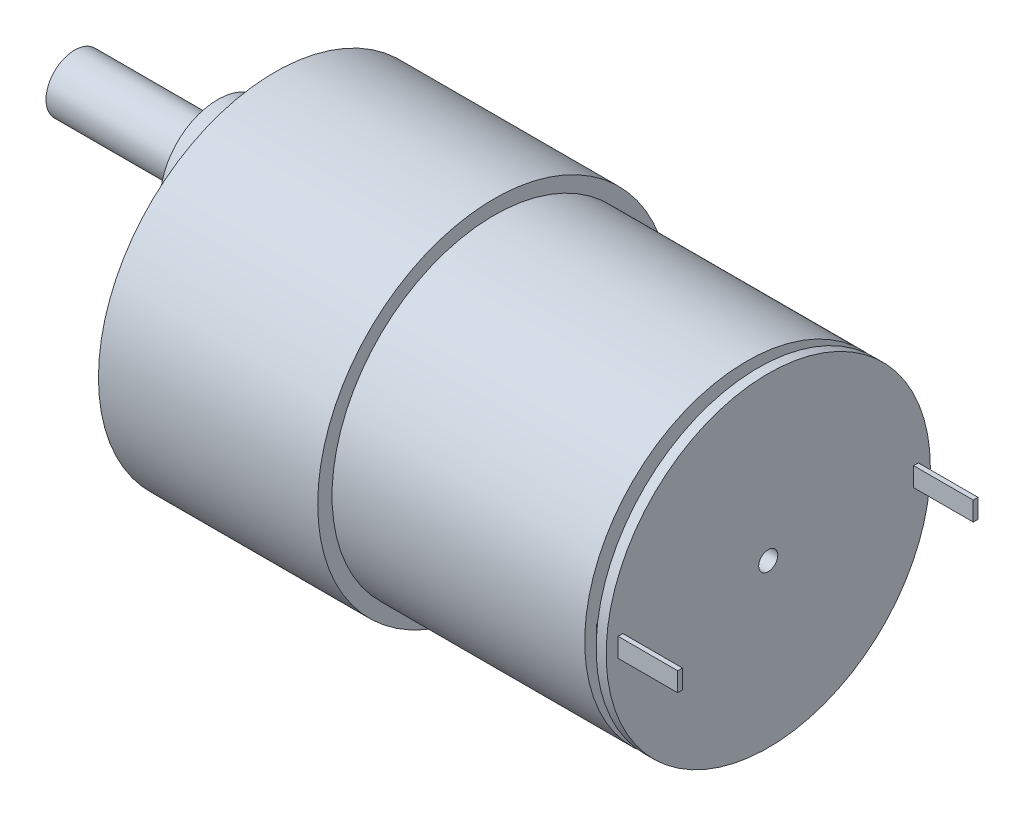
ISO-10303-21;
HEADER;
FILE_DESCRIPTION(('STEP AP214'),'2;1');
FILE_NAME('part.step','',(''),(''),'','','');
FILE_SCHEMA(('AUTOMOTIVE_DESIGN { 1 0 10303 214 1 1 1 1 }'));
ENDSEC;
DATA;
#1=APPLICATION_CONTEXT('core data for automotive mechanical design processes');
#2=APPLICATION_PROTOCOL_DEFINITION('international standard','automotive_design',2000,#1);
#3=PRODUCT_CONTEXT('',#1,'mechanical');
#4=PRODUCT('Part','Part','',(#3));
#5=PRODUCT_RELATED_PRODUCT_CATEGORY('part','',(#4));
#6=PRODUCT_DEFINITION_FORMATION('','',#4);
#7=PRODUCT_DEFINITION_CONTEXT('part definition',#1,'design');
#8=PRODUCT_DEFINITION('design','',#6,#7);
#9=PRODUCT_DEFINITION_SHAPE('','',#8);
#10=(LENGTH_UNIT() NAMED_UNIT(*) SI_UNIT(.MILLI.,.METRE.));
#11=(NAMED_UNIT(*) PLANE_ANGLE_UNIT() SI_UNIT($,.RADIAN.));
#12=(NAMED_UNIT(*) SI_UNIT($,.STERADIAN.) SOLID_ANGLE_UNIT());
#13=UNCERTAINTY_MEASURE_WITH_UNIT(LENGTH_MEASURE(1.E-05),#10,'distance_accuracy_value','');
#14=(GEOMETRIC_REPRESENTATION_CONTEXT(3) GLOBAL_UNCERTAINTY_ASSIGNED_CONTEXT((#13)) GLOBAL_UNIT_ASSIGNED_CONTEXT((#10,
#11,#12)) REPRESENTATION_CONTEXT('',''));
#15=CARTESIAN_POINT('',(0.,0.,0.));
#16=DIRECTION('',(0.,0.,1.));
#17=DIRECTION('',(1.,0.,0.));
#18=AXIS2_PLACEMENT_3D('',#15,#16,#17);
#19=CARTESIAN_POINT('',(40.2,0.,0.));
#20=DIRECTION('',(1.,0.,0.));
#21=DIRECTION('',(0.,0.,-1.));
#22=AXIS2_PLACEMENT_3D('',#19,#20,#21);
#23=CYLINDRICAL_SURFACE('',#22,17.);
#24=CARTESIAN_POINT('',(40.2,0.,0.));
#25=DIRECTION('',(1.,0.,0.));
#26=DIRECTION('',(0.,0.,-1.));
#27=AXIS2_PLACEMENT_3D('',#24,#25,#26);
#28=CIRCLE('',#27,17.);
#29=CARTESIAN_POINT('',(40.2,0.,-17.));
#30=VERTEX_POINT('',#29);
#31=EDGE_CURVE('E341',#30,#30,#28,.T.);
#32=ORIENTED_EDGE('',*,*,#31,.T.);
#33=EDGE_LOOP('',(#32));
#34=FACE_BOUND('',#33,.T.);
#35=CARTESIAN_POINT('',(41.25,0.,0.));
#36=DIRECTION('',(1.,0.,0.));
#37=DIRECTION('',(0.,0.,-1.));
#38=AXIS2_PLACEMENT_3D('',#35,#36,#37);
#39=CIRCLE('',#38,17.);
#40=CARTESIAN_POINT('',(41.25,0.,-17.));
#41=VERTEX_POINT('',#40);
#42=EDGE_CURVE('E340',#41,#41,#39,.T.);
#43=ORIENTED_EDGE('',*,*,#42,.F.);
#44=EDGE_LOOP('',(#43));
#45=FACE_BOUND('',#44,.T.);
#46=ADVANCED_FACE('F32',(#34,#45),#23,.T.);
#47=CARTESIAN_POINT('',(40.2,0.,0.));
#48=DIRECTION('',(1.,0.,0.));
#49=DIRECTION('',(0.,0.,-1.));
#50=AXIS2_PLACEMENT_3D('',#47,#48,#49);
#51=PLANE('',#50);
#52=CARTESIAN_POINT('',(40.2,-2.21813606772281E-13,0.));
#53=DIRECTION('',(1.,0.,0.));
#54=DIRECTION('',(0.,0.,-1.));
#55=AXIS2_PLACEMENT_3D('',#52,#53,#54);
#56=CIRCLE('',#55,1.5);
#57=CARTESIAN_POINT('',(40.2,-2.21813606772281E-13,-1.49999999999998));
#58=VERTEX_POINT('',#57);
#59=EDGE_CURVE('E11',#58,#58,#56,.F.);
#60=ORIENTED_EDGE('',*,*,#59,.F.);
#61=EDGE_LOOP('',(#60));
#62=FACE_BOUND('',#61,.T.);
#63=DIRECTION('',(0.,1.,0.));
#64=VECTOR('',#63,1.);
#65=CARTESIAN_POINT('',(40.2,0.,-15.75));
#66=LINE('',#65,#64);
#67=CARTESIAN_POINT('',(40.2,-0.999999999999999,-15.75));
#68=VERTEX_POINT('',#67);
#69=CARTESIAN_POINT('',(40.2,0.999999999999999,-15.75));
#70=VERTEX_POINT('',#69);
#71=EDGE_CURVE('E264',#68,#70,#66,.T.);
#72=ORIENTED_EDGE('',*,*,#71,.T.);
#73=DIRECTION('',(0.,0.,1.));
#74=VECTOR('',#73,1.);
#75=CARTESIAN_POINT('',(40.2,0.999999999999999,0.));
#76=LINE('',#75,#74);
#77=CARTESIAN_POINT('',(40.2,0.999999999999999,-15.25));
#78=VERTEX_POINT('',#77);
#79=EDGE_CURVE('E285',#70,#78,#76,.T.);
#80=ORIENTED_EDGE('',*,*,#79,.T.);
#81=DIRECTION('',(0.,-1.,0.));
#82=VECTOR('',#81,1.);
#83=CARTESIAN_POINT('',(40.2,0.,-15.25));
#84=LINE('',#83,#82);
#85=CARTESIAN_POINT('',(40.2,-0.999999999999999,-15.25));
#86=VERTEX_POINT('',#85);
#87=EDGE_CURVE('E282',#78,#86,#84,.T.);
#88=ORIENTED_EDGE('',*,*,#87,.T.);
#89=DIRECTION('',(0.,0.,-1.));
#90=VECTOR('',#89,1.);
#91=CARTESIAN_POINT('',(40.2,-0.999999999999999,0.));
#92=LINE('',#91,#90);
#93=EDGE_CURVE('E279',#86,#68,#92,.T.);
#94=ORIENTED_EDGE('',*,*,#93,.T.);
#95=EDGE_LOOP('',(#72,#80,#88,#94));
#96=FACE_BOUND('',#95,.T.);
#97=DIRECTION('',(0.,1.,0.));
#98=VECTOR('',#97,1.);
#99=CARTESIAN_POINT('',(40.2,0.,15.25));
#100=LINE('',#99,#98);
#101=CARTESIAN_POINT('',(40.2,-0.999999999999999,15.25));
#102=VERTEX_POINT('',#101);
#103=CARTESIAN_POINT('',(40.2,0.999999999999999,15.25));
#104=VERTEX_POINT('',#103);
#105=EDGE_CURVE('E316',#102,#104,#100,.T.);
#106=ORIENTED_EDGE('',*,*,#105,.T.);
#107=DIRECTION('',(0.,0.,1.));
#108=VECTOR('',#107,1.);
#109=CARTESIAN_POINT('',(40.2,0.999999999999999,0.));
#110=LINE('',#109,#108);
#111=CARTESIAN_POINT('',(40.2,0.999999999999999,15.75));
#112=VERTEX_POINT('',#111);
#113=EDGE_CURVE('E337',#104,#112,#110,.T.);
#114=ORIENTED_EDGE('',*,*,#113,.T.);
#115=DIRECTION('',(0.,-1.,0.));
#116=VECTOR('',#115,1.);
#117=CARTESIAN_POINT('',(40.2,0.,15.75));
#118=LINE('',#117,#116);
#119=CARTESIAN_POINT('',(40.2,-0.999999999999999,15.75));
#120=VERTEX_POINT('',#119);
#121=EDGE_CURVE('E334',#112,#120,#118,.T.);
#122=ORIENTED_EDGE('',*,*,#121,.T.);
#123=DIRECTION('',(0.,0.,-1.));
#124=VECTOR('',#123,1.);
#125=CARTESIAN_POINT('',(40.2,-0.999999999999999,0.));
#126=LINE('',#125,#124);
#127=EDGE_CURVE('E331',#120,#102,#126,.T.);
#128=ORIENTED_EDGE('',*,*,#127,.T.);
#129=EDGE_LOOP('',(#106,#114,#122,#128));
#130=FACE_BOUND('',#129,.T.);
#131=ORIENTED_EDGE('',*,*,#31,.F.);
#132=EDGE_LOOP('',(#131));
#133=FACE_BOUND('',#132,.T.);
#134=ADVANCED_FACE('F394',(#62,#96,#130,#133),#51,.F.);
#135=CARTESIAN_POINT('',(41.25,0.,0.));
#136=DIRECTION('',(1.,0.,0.));
#137=DIRECTION('',(0.,0.,-1.));
#138=AXIS2_PLACEMENT_3D('',#135,#136,#137);
#139=PLANE('',#138);
#140=CARTESIAN_POINT('',(41.25,-1.46316292415369E-13,0.));
#141=DIRECTION('',(1.,0.,0.));
#142=DIRECTION('',(0.,0.,-1.));
#143=AXIS2_PLACEMENT_3D('',#140,#141,#142);
#144=CIRCLE('',#143,0.999999999999989);
#145=CARTESIAN_POINT('',(41.25,-1.46316292415369E-13,-1.00000000000001));
#146=VERTEX_POINT('',#145);
#147=EDGE_CURVE('E207',#146,#146,#144,.T.);
#148=ORIENTED_EDGE('',*,*,#147,.F.);
#149=EDGE_LOOP('',(#148));
#150=FACE_BOUND('',#149,.T.);
#151=DIRECTION('',(0.,0.,1.));
#152=VECTOR('',#151,1.);
#153=CARTESIAN_POINT('',(41.25,0.999999999999999,0.));
#154=LINE('',#153,#152);
#155=CARTESIAN_POINT('',(41.25,0.999999999999999,-15.75));
#156=VERTEX_POINT('',#155);
#157=CARTESIAN_POINT('',(41.25,0.999999999999999,-15.25));
#158=VERTEX_POINT('',#157);
#159=EDGE_CURVE('E39',#156,#158,#154,.T.);
#160=ORIENTED_EDGE('',*,*,#159,.F.);
#161=DIRECTION('',(0.,1.,0.));
#162=VECTOR('',#161,1.);
#163=CARTESIAN_POINT('',(41.25,0.,-15.75));
#164=LINE('',#163,#162);
#165=CARTESIAN_POINT('',(41.25,-0.999999999999999,-15.75));
#166=VERTEX_POINT('',#165);
#167=EDGE_CURVE('E358',#166,#156,#164,.T.);
#168=ORIENTED_EDGE('',*,*,#167,.F.);
#169=DIRECTION('',(0.,0.,-1.));
#170=VECTOR('',#169,1.);
#171=CARTESIAN_POINT('',(41.25,-0.999999999999999,0.));
#172=LINE('',#171,#170);
#173=CARTESIAN_POINT('',(41.25,-0.999999999999999,-15.25));
#174=VERTEX_POINT('',#173);
#175=EDGE_CURVE('E361',#174,#166,#172,.T.);
#176=ORIENTED_EDGE('',*,*,#175,.F.);
#177=DIRECTION('',(0.,-1.,0.));
#178=VECTOR('',#177,1.);
#179=CARTESIAN_POINT('',(41.25,0.,-15.25));
#180=LINE('',#179,#178);
#181=EDGE_CURVE('E54',#158,#174,#180,.T.);
#182=ORIENTED_EDGE('',*,*,#181,.F.);
#183=EDGE_LOOP('',(#160,#168,#176,#182));
#184=FACE_BOUND('',#183,.T.);
#185=DIRECTION('',(0.,0.,1.));
#186=VECTOR('',#185,1.);
#187=CARTESIAN_POINT('',(41.25,0.999999999999999,0.));
#188=LINE('',#187,#186);
#189=CARTESIAN_POINT('',(41.25,0.999999999999999,15.25));
#190=VERTEX_POINT('',#189);
#191=CARTESIAN_POINT('',(41.25,0.999999999999999,15.75));
#192=VERTEX_POINT('',#191);
#193=EDGE_CURVE('E355',#190,#192,#188,.T.);
#194=ORIENTED_EDGE('',*,*,#193,.F.);
#195=DIRECTION('',(0.,1.,0.));
#196=VECTOR('',#195,1.);
#197=CARTESIAN_POINT('',(41.25,0.,15.25));
#198=LINE('',#197,#196);
#199=CARTESIAN_POINT('',(41.25,-0.999999999999999,15.25));
#200=VERTEX_POINT('',#199);
#201=EDGE_CURVE('E344',#200,#190,#198,.T.);
#202=ORIENTED_EDGE('',*,*,#201,.F.);
#203=DIRECTION('',(0.,0.,-1.));
#204=VECTOR('',#203,1.);
#205=CARTESIAN_POINT('',(41.25,-0.999999999999999,0.));
#206=LINE('',#205,#204);
#207=CARTESIAN_POINT('',(41.25,-0.999999999999999,15.75));
#208=VERTEX_POINT('',#207);
#209=EDGE_CURVE('E349',#208,#200,#206,.T.);
#210=ORIENTED_EDGE('',*,*,#209,.F.);
#211=DIRECTION('',(0.,-1.,0.));
#212=VECTOR('',#211,1.);
#213=CARTESIAN_POINT('',(41.25,0.,15.75));
#214=LINE('',#213,#212);
#215=EDGE_CURVE('E352',#192,#208,#214,.T.);
#216=ORIENTED_EDGE('',*,*,#215,.F.);
#217=EDGE_LOOP('',(#194,#202,#210,#216));
#218=FACE_BOUND('',#217,.T.);
#219=ORIENTED_EDGE('',*,*,#42,.T.);
#220=EDGE_LOOP('',(#219));
#221=FACE_BOUND('',#220,.T.);
#222=ADVANCED_FACE('F376',(#150,#184,#218,#221),#139,.T.);
#223=CARTESIAN_POINT('',(47.5,0.,0.));
#224=DIRECTION('',(1.,0.,0.));
#225=DIRECTION('',(0.,0.,-1.));
#226=AXIS2_PLACEMENT_3D('',#223,#224,#225);
#227=PLANE('',#226);
#228=DIRECTION('',(0.,0.,-1.));
#229=VECTOR('',#228,1.);
#230=CARTESIAN_POINT('',(47.5,0.999999999999999,15.25));
#231=LINE('',#230,#229);
#232=CARTESIAN_POINT('',(47.5,0.999999999999999,15.75));
#233=VERTEX_POINT('',#232);
#234=CARTESIAN_POINT('',(47.5,0.999999999999999,15.25));
#235=VERTEX_POINT('',#234);
#236=EDGE_CURVE('E300',#233,#235,#231,.T.);
#237=ORIENTED_EDGE('',*,*,#236,.F.);
#238=DIRECTION('',(0.,1.,0.));
#239=VECTOR('',#238,1.);
#240=CARTESIAN_POINT('',(47.5,0.999999999999999,15.75));
#241=LINE('',#240,#239);
#242=CARTESIAN_POINT('',(47.5,-0.999999999999999,15.75));
#243=VERTEX_POINT('',#242);
#244=EDGE_CURVE('E309',#243,#233,#241,.T.);
#245=ORIENTED_EDGE('',*,*,#244,.F.);
#246=DIRECTION('',(0.,0.,1.));
#247=VECTOR('',#246,1.);
#248=CARTESIAN_POINT('',(47.5,-0.999999999999999,15.75));
#249=LINE('',#248,#247);
#250=CARTESIAN_POINT('',(47.5,-0.999999999999999,15.25));
#251=VERTEX_POINT('',#250);
#252=EDGE_CURVE('E306',#251,#243,#249,.T.);
#253=ORIENTED_EDGE('',*,*,#252,.F.);
#254=DIRECTION('',(0.,-1.,0.));
#255=VECTOR('',#254,1.);
#256=CARTESIAN_POINT('',(47.5,-0.999999999999999,15.25));
#257=LINE('',#256,#255);
#258=EDGE_CURVE('E303',#235,#251,#257,.T.);
#259=ORIENTED_EDGE('',*,*,#258,.F.);
#260=EDGE_LOOP('',(#237,#245,#253,#259));
#261=FACE_BOUND('',#260,.T.);
#262=ADVANCED_FACE('F406',(#261),#227,.T.);
#263=CARTESIAN_POINT('',(47.5,-0.999999999999999,15.25));
#264=DIRECTION('',(0.,0.,-1.));
#265=DIRECTION('',(-1.,0.,0.));
#266=AXIS2_PLACEMENT_3D('',#263,#264,#265);
#267=PLANE('',#266);
#268=DIRECTION('',(-1.,0.,0.));
#269=VECTOR('',#268,1.);
#270=CARTESIAN_POINT('',(47.5,-0.999999999999999,15.25));
#271=LINE('',#270,#269);
#272=EDGE_CURVE('E322',#251,#200,#271,.T.);
#273=ORIENTED_EDGE('',*,*,#272,.T.);
#274=ORIENTED_EDGE('',*,*,#201,.T.);
#275=DIRECTION('',(-1.,0.,0.));
#276=VECTOR('',#275,1.);
#277=CARTESIAN_POINT('',(47.5,0.999999999999999,15.25));
#278=LINE('',#277,#276);
#279=EDGE_CURVE('E326',#235,#190,#278,.T.);
#280=ORIENTED_EDGE('',*,*,#279,.F.);
#281=ORIENTED_EDGE('',*,*,#258,.T.);
#282=EDGE_LOOP('',(#273,#274,#280,#281));
#283=FACE_BOUND('',#282,.T.);
#284=ADVANCED_FACE('F411',(#283),#267,.T.);
#285=CARTESIAN_POINT('',(47.5,-0.999999999999999,15.75));
#286=DIRECTION('',(0.,-1.,0.));
#287=DIRECTION('',(0.,0.,-1.));
#288=AXIS2_PLACEMENT_3D('',#285,#286,#287);
#289=PLANE('',#288);
#290=DIRECTION('',(-1.,0.,0.));
#291=VECTOR('',#290,1.);
#292=CARTESIAN_POINT('',(47.5,-0.999999999999999,15.75));
#293=LINE('',#292,#291);
#294=EDGE_CURVE('E318',#243,#208,#293,.T.);
#295=ORIENTED_EDGE('',*,*,#294,.T.);
#296=ORIENTED_EDGE('',*,*,#209,.T.);
#297=ORIENTED_EDGE('',*,*,#272,.F.);
#298=ORIENTED_EDGE('',*,*,#252,.T.);
#299=EDGE_LOOP('',(#295,#296,#297,#298));
#300=FACE_BOUND('',#299,.T.);
#301=ADVANCED_FACE('F424',(#300),#289,.T.);
#302=CARTESIAN_POINT('',(47.5,0.999999999999999,15.75));
#303=DIRECTION('',(0.,0.,1.));
#304=DIRECTION('',(1.,0.,0.));
#305=AXIS2_PLACEMENT_3D('',#302,#303,#304);
#306=PLANE('',#305);
#307=DIRECTION('',(-1.,0.,0.));
#308=VECTOR('',#307,1.);
#309=CARTESIAN_POINT('',(47.5,0.999999999999999,15.75));
#310=LINE('',#309,#308);
#311=EDGE_CURVE('E313',#233,#192,#310,.T.);
#312=ORIENTED_EDGE('',*,*,#311,.T.);
#313=ORIENTED_EDGE('',*,*,#215,.T.);
#314=ORIENTED_EDGE('',*,*,#294,.F.);
#315=ORIENTED_EDGE('',*,*,#244,.T.);
#316=EDGE_LOOP('',(#312,#313,#314,#315));
#317=FACE_BOUND('',#316,.T.);
#318=ADVANCED_FACE('F420',(#317),#306,.T.);
#319=CARTESIAN_POINT('',(47.5,0.999999999999999,15.25));
#320=DIRECTION('',(0.,1.,0.));
#321=DIRECTION('',(0.,0.,1.));
#322=AXIS2_PLACEMENT_3D('',#319,#320,#321);
#323=PLANE('',#322);
#324=ORIENTED_EDGE('',*,*,#279,.T.);
#325=ORIENTED_EDGE('',*,*,#193,.T.);
#326=ORIENTED_EDGE('',*,*,#311,.F.);
#327=ORIENTED_EDGE('',*,*,#236,.T.);
#328=EDGE_LOOP('',(#324,#325,#326,#327));
#329=FACE_BOUND('',#328,.T.);
#330=ADVANCED_FACE('F416',(#329),#323,.T.);
#331=ORIENTED_EDGE('',*,*,#113,.F.);
#332=CARTESIAN_POINT('',(39.,0.999999999999999,15.25));
#333=VERTEX_POINT('',#332);
#334=EDGE_CURVE('E312',#104,#333,#278,.T.);
#335=ORIENTED_EDGE('',*,*,#334,.T.);
#336=DIRECTION('',(0.,0.,-1.));
#337=VECTOR('',#336,1.);
#338=CARTESIAN_POINT('',(39.,0.999999999999999,15.25));
#339=LINE('',#338,#337);
#340=CARTESIAN_POINT('',(39.,0.999999999999999,15.75));
#341=VERTEX_POINT('',#340);
#342=EDGE_CURVE('E288',#341,#333,#339,.T.);
#343=ORIENTED_EDGE('',*,*,#342,.F.);
#344=EDGE_CURVE('E317',#112,#341,#310,.T.);
#345=ORIENTED_EDGE('',*,*,#344,.F.);
#346=EDGE_LOOP('',(#331,#335,#343,#345));
#347=FACE_BOUND('',#346,.T.);
#348=ADVANCED_FACE('F419',(#347),#323,.T.);
#349=ORIENTED_EDGE('',*,*,#121,.F.);
#350=ORIENTED_EDGE('',*,*,#344,.T.);
#351=DIRECTION('',(0.,1.,0.));
#352=VECTOR('',#351,1.);
#353=CARTESIAN_POINT('',(39.,0.999999999999999,15.75));
#354=LINE('',#353,#352);
#355=CARTESIAN_POINT('',(39.,-0.999999999999999,15.75));
#356=VERTEX_POINT('',#355);
#357=EDGE_CURVE('E297',#356,#341,#354,.T.);
#358=ORIENTED_EDGE('',*,*,#357,.F.);
#359=EDGE_CURVE('E321',#120,#356,#293,.T.);
#360=ORIENTED_EDGE('',*,*,#359,.F.);
#361=EDGE_LOOP('',(#349,#350,#358,#360));
#362=FACE_BOUND('',#361,.T.);
#363=ADVANCED_FACE('F433',(#362),#306,.T.);
#364=ORIENTED_EDGE('',*,*,#127,.F.);
#365=ORIENTED_EDGE('',*,*,#359,.T.);
#366=DIRECTION('',(0.,0.,1.));
#367=VECTOR('',#366,1.);
#368=CARTESIAN_POINT('',(39.,-0.999999999999999,15.75));
#369=LINE('',#368,#367);
#370=CARTESIAN_POINT('',(39.,-0.999999999999999,15.25));
#371=VERTEX_POINT('',#370);
#372=EDGE_CURVE('E294',#371,#356,#369,.T.);
#373=ORIENTED_EDGE('',*,*,#372,.F.);
#374=EDGE_CURVE('E325',#102,#371,#271,.T.);
#375=ORIENTED_EDGE('',*,*,#374,.F.);
#376=EDGE_LOOP('',(#364,#365,#373,#375));
#377=FACE_BOUND('',#376,.T.);
#378=ADVANCED_FACE('F430',(#377),#289,.T.);
#379=ORIENTED_EDGE('',*,*,#105,.F.);
#380=ORIENTED_EDGE('',*,*,#374,.T.);
#381=DIRECTION('',(0.,-1.,0.));
#382=VECTOR('',#381,1.);
#383=CARTESIAN_POINT('',(39.,-0.999999999999999,15.25));
#384=LINE('',#383,#382);
#385=EDGE_CURVE('E291',#333,#371,#384,.T.);
#386=ORIENTED_EDGE('',*,*,#385,.F.);
#387=ORIENTED_EDGE('',*,*,#334,.F.);
#388=EDGE_LOOP('',(#379,#380,#386,#387));
#389=FACE_BOUND('',#388,.T.);
#390=ADVANCED_FACE('F426',(#389),#267,.T.);
#391=CARTESIAN_POINT('',(47.5,0.,0.));
#392=DIRECTION('',(1.,0.,0.));
#393=DIRECTION('',(0.,0.,-1.));
#394=AXIS2_PLACEMENT_3D('',#391,#392,#393);
#395=PLANE('',#394);
#396=DIRECTION('',(0.,0.,-1.));
#397=VECTOR('',#396,1.);
#398=CARTESIAN_POINT('',(47.5,0.999999999999999,-15.75));
#399=LINE('',#398,#397);
#400=CARTESIAN_POINT('',(47.5,0.999999999999999,-15.25));
#401=VERTEX_POINT('',#400);
#402=CARTESIAN_POINT('',(47.5,0.999999999999999,-15.75));
#403=VERTEX_POINT('',#402);
#404=EDGE_CURVE('E249',#401,#403,#399,.T.);
#405=ORIENTED_EDGE('',*,*,#404,.F.);
#406=DIRECTION('',(0.,1.,0.));
#407=VECTOR('',#406,1.);
#408=CARTESIAN_POINT('',(47.5,0.999999999999999,-15.25));
#409=LINE('',#408,#407);
#410=CARTESIAN_POINT('',(47.5,-0.999999999999999,-15.25));
#411=VERTEX_POINT('',#410);
#412=EDGE_CURVE('E258',#411,#401,#409,.T.);
#413=ORIENTED_EDGE('',*,*,#412,.F.);
#414=DIRECTION('',(0.,0.,1.));
#415=VECTOR('',#414,1.);
#416=CARTESIAN_POINT('',(47.5,-0.999999999999999,-15.25));
#417=LINE('',#416,#415);
#418=CARTESIAN_POINT('',(47.5,-0.999999999999999,-15.75));
#419=VERTEX_POINT('',#418);
#420=EDGE_CURVE('E255',#419,#411,#417,.T.);
#421=ORIENTED_EDGE('',*,*,#420,.F.);
#422=DIRECTION('',(0.,-1.,0.));
#423=VECTOR('',#422,1.);
#424=CARTESIAN_POINT('',(47.5,-0.999999999999999,-15.75));
#425=LINE('',#424,#423);
#426=EDGE_CURVE('E252',#403,#419,#425,.T.);
#427=ORIENTED_EDGE('',*,*,#426,.F.);
#428=EDGE_LOOP('',(#405,#413,#421,#427));
#429=FACE_BOUND('',#428,.T.);
#430=ADVANCED_FACE('F372',(#429),#395,.T.);
#431=CARTESIAN_POINT('',(47.5,-0.999999999999999,-15.75));
#432=DIRECTION('',(0.,0.,-1.));
#433=DIRECTION('',(-1.,0.,0.));
#434=AXIS2_PLACEMENT_3D('',#431,#432,#433);
#435=PLANE('',#434);
#436=DIRECTION('',(-1.,0.,0.));
#437=VECTOR('',#436,1.);
#438=CARTESIAN_POINT('',(47.5,-0.999999999999999,-15.75));
#439=LINE('',#438,#437);
#440=EDGE_CURVE('E270',#419,#166,#439,.T.);
#441=ORIENTED_EDGE('',*,*,#440,.T.);
#442=ORIENTED_EDGE('',*,*,#167,.T.);
#443=DIRECTION('',(-1.,0.,0.));
#444=VECTOR('',#443,1.);
#445=CARTESIAN_POINT('',(47.5,0.999999999999999,-15.75));
#446=LINE('',#445,#444);
#447=EDGE_CURVE('E274',#403,#156,#446,.T.);
#448=ORIENTED_EDGE('',*,*,#447,.F.);
#449=ORIENTED_EDGE('',*,*,#426,.T.);
#450=EDGE_LOOP('',(#441,#442,#448,#449));
#451=FACE_BOUND('',#450,.T.);
#452=ADVANCED_FACE('F375',(#451),#435,.T.);
#453=CARTESIAN_POINT('',(47.5,-0.999999999999999,-15.25));
#454=DIRECTION('',(0.,-1.,0.));
#455=DIRECTION('',(0.,0.,-1.));
#456=AXIS2_PLACEMENT_3D('',#453,#454,#455);
#457=PLANE('',#456);
#458=DIRECTION('',(-1.,0.,0.));
#459=VECTOR('',#458,1.);
#460=CARTESIAN_POINT('',(47.5,-0.999999999999999,-15.25));
#461=LINE('',#460,#459);
#462=EDGE_CURVE('E266',#411,#174,#461,.T.);
#463=ORIENTED_EDGE('',*,*,#462,.T.);
#464=ORIENTED_EDGE('',*,*,#175,.T.);
#465=ORIENTED_EDGE('',*,*,#440,.F.);
#466=ORIENTED_EDGE('',*,*,#420,.T.);
#467=EDGE_LOOP('',(#463,#464,#465,#466));
#468=FACE_BOUND('',#467,.T.);
#469=ADVANCED_FACE('F379',(#468),#457,.T.);
#470=CARTESIAN_POINT('',(47.5,0.999999999999999,-15.25));
#471=DIRECTION('',(0.,0.,1.));
#472=DIRECTION('',(1.,0.,0.));
#473=AXIS2_PLACEMENT_3D('',#470,#471,#472);
#474=PLANE('',#473);
#475=DIRECTION('',(-1.,0.,0.));
#476=VECTOR('',#475,1.);
#477=CARTESIAN_POINT('',(47.5,0.999999999999999,-15.25));
#478=LINE('',#477,#476);
#479=EDGE_CURVE('E261',#401,#158,#478,.T.);
#480=ORIENTED_EDGE('',*,*,#479,.T.);
#481=ORIENTED_EDGE('',*,*,#181,.T.);
#482=ORIENTED_EDGE('',*,*,#462,.F.);
#483=ORIENTED_EDGE('',*,*,#412,.T.);
#484=EDGE_LOOP('',(#480,#481,#482,#483));
#485=FACE_BOUND('',#484,.T.);
#486=ADVANCED_FACE('F368',(#485),#474,.T.);
#487=CARTESIAN_POINT('',(47.5,0.999999999999999,-15.75));
#488=DIRECTION('',(0.,1.,0.));
#489=DIRECTION('',(0.,0.,1.));
#490=AXIS2_PLACEMENT_3D('',#487,#488,#489);
#491=PLANE('',#490);
#492=ORIENTED_EDGE('',*,*,#447,.T.);
#493=ORIENTED_EDGE('',*,*,#159,.T.);
#494=ORIENTED_EDGE('',*,*,#479,.F.);
#495=ORIENTED_EDGE('',*,*,#404,.T.);
#496=EDGE_LOOP('',(#492,#493,#494,#495));
#497=FACE_BOUND('',#496,.T.);
#498=ADVANCED_FACE('F365',(#497),#491,.T.);
#499=ORIENTED_EDGE('',*,*,#79,.F.);
#500=CARTESIAN_POINT('',(39.,0.999999999999999,-15.75));
#501=VERTEX_POINT('',#500);
#502=EDGE_CURVE('E46',#70,#501,#446,.T.);
#503=ORIENTED_EDGE('',*,*,#502,.T.);
#504=DIRECTION('',(0.,0.,-1.));
#505=VECTOR('',#504,1.);
#506=CARTESIAN_POINT('',(39.,0.999999999999999,-15.75));
#507=LINE('',#506,#505);
#508=CARTESIAN_POINT('',(39.,0.999999999999999,-15.25));
#509=VERTEX_POINT('',#508);
#510=EDGE_CURVE('E237',#509,#501,#507,.T.);
#511=ORIENTED_EDGE('',*,*,#510,.F.);
#512=EDGE_CURVE('E265',#78,#509,#478,.T.);
#513=ORIENTED_EDGE('',*,*,#512,.F.);
#514=EDGE_LOOP('',(#499,#503,#511,#513));
#515=FACE_BOUND('',#514,.T.);
#516=ADVANCED_FACE('F436',(#515),#491,.T.);
#517=ORIENTED_EDGE('',*,*,#87,.F.);
#518=ORIENTED_EDGE('',*,*,#512,.T.);
#519=DIRECTION('',(0.,1.,0.));
#520=VECTOR('',#519,1.);
#521=CARTESIAN_POINT('',(39.,0.999999999999999,-15.25));
#522=LINE('',#521,#520);
#523=CARTESIAN_POINT('',(39.,-0.999999999999999,-15.25));
#524=VERTEX_POINT('',#523);
#525=EDGE_CURVE('E246',#524,#509,#522,.T.);
#526=ORIENTED_EDGE('',*,*,#525,.F.);
#527=EDGE_CURVE('E269',#86,#524,#461,.T.);
#528=ORIENTED_EDGE('',*,*,#527,.F.);
#529=EDGE_LOOP('',(#517,#518,#526,#528));
#530=FACE_BOUND('',#529,.T.);
#531=ADVANCED_FACE('F388',(#530),#474,.T.);
#532=ORIENTED_EDGE('',*,*,#93,.F.);
#533=ORIENTED_EDGE('',*,*,#527,.T.);
#534=DIRECTION('',(0.,0.,1.));
#535=VECTOR('',#534,1.);
#536=CARTESIAN_POINT('',(39.,-0.999999999999999,-15.25));
#537=LINE('',#536,#535);
#538=CARTESIAN_POINT('',(39.,-0.999999999999999,-15.75));
#539=VERTEX_POINT('',#538);
#540=EDGE_CURVE('E243',#539,#524,#537,.T.);
#541=ORIENTED_EDGE('',*,*,#540,.F.);
#542=EDGE_CURVE('E273',#68,#539,#439,.T.);
#543=ORIENTED_EDGE('',*,*,#542,.F.);
#544=EDGE_LOOP('',(#532,#533,#541,#543));
#545=FACE_BOUND('',#544,.T.);
#546=ADVANCED_FACE('F382',(#545),#457,.T.);
#547=ORIENTED_EDGE('',*,*,#71,.F.);
#548=ORIENTED_EDGE('',*,*,#542,.T.);
#549=DIRECTION('',(0.,-1.,0.));
#550=VECTOR('',#549,1.);
#551=CARTESIAN_POINT('',(39.,-0.999999999999999,-15.75));
#552=LINE('',#551,#550);
#553=EDGE_CURVE('E240',#501,#539,#552,.T.);
#554=ORIENTED_EDGE('',*,*,#553,.F.);
#555=ORIENTED_EDGE('',*,*,#502,.F.);
#556=EDGE_LOOP('',(#547,#548,#554,#555));
#557=FACE_BOUND('',#556,.T.);
#558=ADVANCED_FACE('F390',(#557),#435,.T.);
#559=CARTESIAN_POINT('',(39.,-2.21813606772281E-13,0.));
#560=DIRECTION('',(1.,0.,0.));
#561=DIRECTION('',(0.,0.,-1.));
#562=AXIS2_PLACEMENT_3D('',#559,#560,#561);
#563=CYLINDRICAL_SURFACE('',#562,1.5);
#564=CARTESIAN_POINT('',(39.,-2.21813606772281E-13,0.));
#565=DIRECTION('',(-1.,0.,0.));
#566=DIRECTION('',(0.,0.,1.));
#567=AXIS2_PLACEMENT_3D('',#564,#565,#566);
#568=CIRCLE('',#567,1.5);
#569=CARTESIAN_POINT('',(39.,-2.21813606772281E-13,1.50000000000002));
#570=VERTEX_POINT('',#569);
#571=EDGE_CURVE('E234',#570,#570,#568,.T.);
#572=ORIENTED_EDGE('',*,*,#571,.F.);
#573=EDGE_LOOP('',(#572));
#574=FACE_BOUND('',#573,.T.);
#575=ORIENTED_EDGE('',*,*,#59,.T.);
#576=EDGE_LOOP('',(#575));
#577=FACE_BOUND('',#576,.T.);
#578=ADVANCED_FACE('F466',(#574,#577),#563,.T.);
#579=CARTESIAN_POINT('',(12.5,0.,0.));
#580=DIRECTION('',(1.,0.,0.));
#581=DIRECTION('',(0.,0.,-1.));
#582=AXIS2_PLACEMENT_3D('',#579,#580,#581);
#583=CYLINDRICAL_SURFACE('',#582,17.);
#584=CARTESIAN_POINT('',(12.5,0.,0.));
#585=DIRECTION('',(1.,0.,0.));
#586=DIRECTION('',(0.,0.,-1.));
#587=AXIS2_PLACEMENT_3D('',#584,#585,#586);
#588=CIRCLE('',#587,17.);
#589=CARTESIAN_POINT('',(12.5,0.,-17.));
#590=VERTEX_POINT('',#589);
#591=EDGE_CURVE('E228',#590,#590,#588,.T.);
#592=ORIENTED_EDGE('',*,*,#591,.T.);
#593=EDGE_LOOP('',(#592));
#594=FACE_BOUND('',#593,.T.);
#595=CARTESIAN_POINT('',(39.,0.,0.));
#596=DIRECTION('',(1.,0.,0.));
#597=DIRECTION('',(0.,0.,-1.));
#598=AXIS2_PLACEMENT_3D('',#595,#596,#597);
#599=CIRCLE('',#598,17.);
#600=CARTESIAN_POINT('',(39.,0.,-17.));
#601=VERTEX_POINT('',#600);
#602=EDGE_CURVE('E231',#601,#601,#599,.T.);
#603=ORIENTED_EDGE('',*,*,#602,.F.);
#604=EDGE_LOOP('',(#603));
#605=FACE_BOUND('',#604,.T.);
#606=ADVANCED_FACE('F458',(#594,#605),#583,.T.);
#607=CARTESIAN_POINT('',(39.,0.,0.));
#608=DIRECTION('',(1.,0.,0.));
#609=DIRECTION('',(0.,0.,-1.));
#610=AXIS2_PLACEMENT_3D('',#607,#608,#609);
#611=PLANE('',#610);
#612=ORIENTED_EDGE('',*,*,#357,.T.);
#613=ORIENTED_EDGE('',*,*,#342,.T.);
#614=ORIENTED_EDGE('',*,*,#385,.T.);
#615=ORIENTED_EDGE('',*,*,#372,.T.);
#616=EDGE_LOOP('',(#612,#613,#614,#615));
#617=FACE_BOUND('',#616,.T.);
#618=ORIENTED_EDGE('',*,*,#525,.T.);
#619=ORIENTED_EDGE('',*,*,#510,.T.);
#620=ORIENTED_EDGE('',*,*,#553,.T.);
#621=ORIENTED_EDGE('',*,*,#540,.T.);
#622=EDGE_LOOP('',(#618,#619,#620,#621));
#623=FACE_BOUND('',#622,.T.);
#624=ORIENTED_EDGE('',*,*,#571,.T.);
#625=EDGE_LOOP('',(#624));
#626=FACE_BOUND('',#625,.T.);
#627=ORIENTED_EDGE('',*,*,#602,.T.);
#628=EDGE_LOOP('',(#627));
#629=FACE_BOUND('',#628,.T.);
#630=ADVANCED_FACE('F454',(#617,#623,#626,#629),#611,.T.);
#631=CARTESIAN_POINT('',(-9.00000000000003,0.,0.));
#632=DIRECTION('',(1.,0.,0.));
#633=DIRECTION('',(0.,0.,-1.));
#634=AXIS2_PLACEMENT_3D('',#631,#632,#633);
#635=CYLINDRICAL_SURFACE('',#634,18.5);
#636=CARTESIAN_POINT('',(12.5,0.,0.));
#637=DIRECTION('',(1.,0.,0.));
#638=DIRECTION('',(0.,0.,1.));
#639=AXIS2_PLACEMENT_3D('',#636,#637,#638);
#640=CIRCLE('',#639,18.5);
#641=CARTESIAN_POINT('',(12.5,0.,18.5));
#642=VERTEX_POINT('',#641);
#643=EDGE_CURVE('E225',#642,#642,#640,.T.);
#644=ORIENTED_EDGE('',*,*,#643,.F.);
#645=EDGE_LOOP('',(#644));
#646=FACE_BOUND('',#645,.T.);
#647=CARTESIAN_POINT('',(-10.5,0.,0.));
#648=DIRECTION('',(-1.,0.,0.));
#649=DIRECTION('',(0.,0.,1.));
#650=AXIS2_PLACEMENT_3D('',#647,#648,#649);
#651=CIRCLE('',#650,18.5);
#652=CARTESIAN_POINT('',(-10.5,0.,18.5));
#653=VERTEX_POINT('',#652);
#654=EDGE_CURVE('E220',#653,#653,#651,.T.);
#655=ORIENTED_EDGE('',*,*,#654,.F.);
#656=EDGE_LOOP('',(#655));
#657=FACE_BOUND('',#656,.T.);
#658=ADVANCED_FACE('F457',(#646,#657),#635,.T.);
#659=CARTESIAN_POINT('',(12.5,0.,0.));
#660=DIRECTION('',(-1.,0.,0.));
#661=DIRECTION('',(0.,0.,1.));
#662=AXIS2_PLACEMENT_3D('',#659,#660,#661);
#663=PLANE('',#662);
#664=ORIENTED_EDGE('',*,*,#591,.F.);
#665=EDGE_LOOP('',(#664));
#666=FACE_BOUND('',#665,.T.);
#667=ORIENTED_EDGE('',*,*,#643,.T.);
#668=EDGE_LOOP('',(#667));
#669=FACE_BOUND('',#668,.T.);
#670=ADVANCED_FACE('F553',(#666,#669),#663,.F.);
#671=CARTESIAN_POINT('',(-10.5,0.,0.));
#672=DIRECTION('',(-1.,0.,0.));
#673=DIRECTION('',(0.,0.,1.));
#674=AXIS2_PLACEMENT_3D('',#671,#672,#673);
#675=PLANE('',#674);
#676=CARTESIAN_POINT('',(-10.5,0.,-15.5));
#677=DIRECTION('',(-1.,0.,0.));
#678=DIRECTION('',(0.,0.,1.));
#679=AXIS2_PLACEMENT_3D('',#676,#677,#678);
#680=CIRCLE('',#679,1.49999999999999);
#681=CARTESIAN_POINT('',(-10.5,0.,-14.));
#682=VERTEX_POINT('',#681);
#683=EDGE_CURVE('E171',#682,#682,#680,.T.);
#684=ORIENTED_EDGE('',*,*,#683,.F.);
#685=EDGE_LOOP('',(#684));
#686=FACE_BOUND('',#685,.T.);
#687=CARTESIAN_POINT('',(-10.5,13.4233937586588,-7.75));
#688=DIRECTION('',(-1.,0.,0.));
#689=DIRECTION('',(0.,0.,1.));
#690=AXIS2_PLACEMENT_3D('',#687,#688,#689);
#691=CIRCLE('',#690,1.49999999999999);
#692=CARTESIAN_POINT('',(-10.5,13.4233937586588,-6.25000000000001));
#693=VERTEX_POINT('',#692);
#694=EDGE_CURVE('E170',#693,#693,#691,.T.);
#695=ORIENTED_EDGE('',*,*,#694,.F.);
#696=EDGE_LOOP('',(#695));
#697=FACE_BOUND('',#696,.T.);
#698=CARTESIAN_POINT('',(-10.5,13.2728586947431,8.0050747697559));
#699=DIRECTION('',(-1.,0.,0.));
#700=DIRECTION('',(0.,0.,1.));
#701=AXIS2_PLACEMENT_3D('',#698,#699,#700);
#702=CIRCLE('',#701,1.49999999999999);
#703=CARTESIAN_POINT('',(-10.5,13.2728586947431,9.50507476975589));
#704=VERTEX_POINT('',#703);
#705=EDGE_CURVE('E183',#704,#704,#702,.T.);
#706=ORIENTED_EDGE('',*,*,#705,.F.);
#707=EDGE_LOOP('',(#706));
#708=FACE_BOUND('',#707,.T.);
#709=CARTESIAN_POINT('',(-10.5,0.,15.5));
#710=DIRECTION('',(-1.,0.,0.));
#711=DIRECTION('',(0.,0.,1.));
#712=AXIS2_PLACEMENT_3D('',#709,#710,#711);
#713=CIRCLE('',#712,1.49999999999999);
#714=CARTESIAN_POINT('',(-10.5,0.,17.));
#715=VERTEX_POINT('',#714);
#716=EDGE_CURVE('E189',#715,#715,#713,.T.);
#717=ORIENTED_EDGE('',*,*,#716,.F.);
#718=EDGE_LOOP('',(#717));
#719=FACE_BOUND('',#718,.T.);
#720=CARTESIAN_POINT('',(-10.5,-13.4233937586589,7.74999999999987));
#721=DIRECTION('',(-1.,0.,0.));
#722=DIRECTION('',(0.,0.,1.));
#723=AXIS2_PLACEMENT_3D('',#720,#721,#722);
#724=CIRCLE('',#723,1.49999999999999);
#725=CARTESIAN_POINT('',(-10.5,-13.4233937586589,9.24999999999986));
#726=VERTEX_POINT('',#725);
#727=EDGE_CURVE('E195',#726,#726,#724,.T.);
#728=ORIENTED_EDGE('',*,*,#727,.F.);
#729=EDGE_LOOP('',(#728));
#730=FACE_BOUND('',#729,.T.);
#731=CARTESIAN_POINT('',(-10.5,-13.4233937586588,-7.75));
#732=DIRECTION('',(-1.,0.,0.));
#733=DIRECTION('',(0.,0.,1.));
#734=AXIS2_PLACEMENT_3D('',#731,#732,#733);
#735=CIRCLE('',#734,1.49999999999999);
#736=CARTESIAN_POINT('',(-10.5,-13.4233937586588,-6.25000000000001));
#737=VERTEX_POINT('',#736);
#738=EDGE_CURVE('E201',#737,#737,#735,.T.);
#739=ORIENTED_EDGE('',*,*,#738,.F.);
#740=EDGE_LOOP('',(#739));
#741=FACE_BOUND('',#740,.T.);
#742=CARTESIAN_POINT('',(-10.5,7.,0.));
#743=DIRECTION('',(-1.,0.,0.));
#744=DIRECTION('',(0.,0.,1.));
#745=AXIS2_PLACEMENT_3D('',#742,#743,#744);
#746=CIRCLE('',#745,6.);
#747=CARTESIAN_POINT('',(-10.5,7.,6.));
#748=VERTEX_POINT('',#747);
#749=EDGE_CURVE('E216',#748,#748,#746,.T.);
#750=ORIENTED_EDGE('',*,*,#749,.F.);
#751=EDGE_LOOP('',(#750));
#752=FACE_BOUND('',#751,.T.);
#753=ORIENTED_EDGE('',*,*,#654,.T.);
#754=EDGE_LOOP('',(#753));
#755=FACE_BOUND('',#754,.T.);
#756=ADVANCED_FACE('F558',(#686,#697,#708,#719,#730,#741,#752,#755),#675,.T.);
#757=CARTESIAN_POINT('',(-16.5,7.,0.));
#758=DIRECTION('',(1.,0.,0.));
#759=DIRECTION('',(0.,0.,-1.));
#760=AXIS2_PLACEMENT_3D('',#757,#758,#759);
#761=CYLINDRICAL_SURFACE('',#760,6.);
#762=CARTESIAN_POINT('',(-16.5,7.,0.));
#763=DIRECTION('',(-1.,0.,0.));
#764=DIRECTION('',(0.,0.,1.));
#765=AXIS2_PLACEMENT_3D('',#762,#763,#764);
#766=CIRCLE('',#765,6.);
#767=CARTESIAN_POINT('',(-16.5,7.,6.));
#768=VERTEX_POINT('',#767);
#769=EDGE_CURVE('E217',#768,#768,#766,.T.);
#770=ORIENTED_EDGE('',*,*,#769,.F.);
#771=EDGE_LOOP('',(#770));
#772=FACE_BOUND('',#771,.T.);
#773=ORIENTED_EDGE('',*,*,#749,.T.);
#774=EDGE_LOOP('',(#773));
#775=FACE_BOUND('',#774,.T.);
#776=ADVANCED_FACE('F573',(#772,#775),#761,.T.);
#777=CARTESIAN_POINT('',(-16.5,7.,0.));
#778=DIRECTION('',(-1.,0.,0.));
#779=DIRECTION('',(0.,0.,1.));
#780=AXIS2_PLACEMENT_3D('',#777,#778,#779);
#781=PLANE('',#780);
#782=CARTESIAN_POINT('',(-16.5,7.,0.));
#783=DIRECTION('',(-1.,0.,0.));
#784=DIRECTION('',(0.,0.,1.));
#785=AXIS2_PLACEMENT_3D('',#782,#783,#784);
#786=CIRCLE('',#785,3.);
#787=CARTESIAN_POINT('',(-16.5,7.,3.));
#788=VERTEX_POINT('',#787);
#789=EDGE_CURVE('E213',#788,#788,#786,.T.);
#790=ORIENTED_EDGE('',*,*,#789,.F.);
#791=EDGE_LOOP('',(#790));
#792=FACE_BOUND('',#791,.T.);
#793=ORIENTED_EDGE('',*,*,#769,.T.);
#794=EDGE_LOOP('',(#793));
#795=FACE_BOUND('',#794,.T.);
#796=ADVANCED_FACE('F578',(#792,#795),#781,.T.);
#797=CARTESIAN_POINT('',(39.,-1.46867383474985E-13,0.));
#798=DIRECTION('',(-1.,0.,0.));
#799=DIRECTION('',(0.,0.,1.));
#800=AXIS2_PLACEMENT_3D('',#797,#798,#799);
#801=PLANE('',#800);
#802=CARTESIAN_POINT('',(39.,-1.46316292415369E-13,0.));
#803=DIRECTION('',(1.,0.,0.));
#804=DIRECTION('',(0.,0.,-1.));
#805=AXIS2_PLACEMENT_3D('',#802,#803,#804);
#806=CIRCLE('',#805,0.999999999999987);
#807=CARTESIAN_POINT('',(39.,-1.46316292415369E-13,-1.00000000000001));
#808=VERTEX_POINT('',#807);
#809=EDGE_CURVE('E210',#808,#808,#806,.T.);
#810=ORIENTED_EDGE('',*,*,#809,.T.);
#811=EDGE_LOOP('',(#810));
#812=FACE_BOUND('',#811,.T.);
#813=ADVANCED_FACE('F587',(#812),#801,.F.);
#814=CARTESIAN_POINT('',(41.25,-1.46316292415369E-13,0.));
#815=DIRECTION('',(1.,0.,0.));
#816=DIRECTION('',(0.,0.,-1.));
#817=AXIS2_PLACEMENT_3D('',#814,#815,#816);
#818=CYLINDRICAL_SURFACE('',#817,0.999999999999988);
#819=ORIENTED_EDGE('',*,*,#809,.F.);
#820=EDGE_LOOP('',(#819));
#821=FACE_BOUND('',#820,.T.);
#822=ORIENTED_EDGE('',*,*,#147,.T.);
#823=EDGE_LOOP('',(#822));
#824=FACE_BOUND('',#823,.T.);
#825=ADVANCED_FACE('F604',(#821,#824),#818,.F.);
#826=CARTESIAN_POINT('',(-3.00000000000002,-13.4233937586588,-7.75));
#827=DIRECTION('',(-1.,0.,0.));
#828=DIRECTION('',(0.,0.,1.));
#829=AXIS2_PLACEMENT_3D('',#826,#827,#828);
#830=CONICAL_SURFACE('',#829,1.49999999999999,1.02974425867665);
#831=CARTESIAN_POINT('',(-2.09870907145869,-13.4233937586588,-7.75));
#832=VERTEX_POINT('',#831);
#833=VERTEX_LOOP('',#832);
#834=FACE_BOUND('',#833,.T.);
#835=CARTESIAN_POINT('',(-3.00000000000002,-13.4233937586588,-7.75));
#836=DIRECTION('',(-1.,0.,0.));
#837=DIRECTION('',(0.,0.,1.));
#838=AXIS2_PLACEMENT_3D('',#835,#836,#837);
#839=CIRCLE('',#838,1.49999999999999);
#840=CARTESIAN_POINT('',(-3.00000000000002,-13.4233937586588,-6.25000000000001));
#841=VERTEX_POINT('',#840);
#842=EDGE_CURVE('E204',#841,#841,#839,.T.);
#843=ORIENTED_EDGE('',*,*,#842,.T.);
#844=EDGE_LOOP('',(#843));
#845=FACE_BOUND('',#844,.T.);
#846=ADVANCED_FACE('F614',(#834,#845),#830,.F.);
#847=CARTESIAN_POINT('',(-10.5,-13.4233937586588,-7.75));
#848=DIRECTION('',(-1.,0.,0.));
#849=DIRECTION('',(0.,0.,1.));
#850=AXIS2_PLACEMENT_3D('',#847,#848,#849);
#851=CYLINDRICAL_SURFACE('',#850,1.49999999999999);
#852=ORIENTED_EDGE('',*,*,#842,.F.);
#853=EDGE_LOOP('',(#852));
#854=FACE_BOUND('',#853,.T.);
#855=ORIENTED_EDGE('',*,*,#738,.T.);
#856=EDGE_LOOP('',(#855));
#857=FACE_BOUND('',#856,.T.);
#858=ADVANCED_FACE('F631',(#854,#857),#851,.F.);
#859=CARTESIAN_POINT('',(-3.00000000000002,-13.4233937586589,7.74999999999987));
#860=DIRECTION('',(-1.,0.,0.));
#861=DIRECTION('',(0.,0.,1.));
#862=AXIS2_PLACEMENT_3D('',#859,#860,#861);
#863=CONICAL_SURFACE('',#862,1.49999999999999,1.02974425867665);
#864=CARTESIAN_POINT('',(-2.09870907145869,-13.4233937586589,7.74999999999987));
#865=VERTEX_POINT('',#864);
#866=VERTEX_LOOP('',#865);
#867=FACE_BOUND('',#866,.T.);
#868=CARTESIAN_POINT('',(-3.00000000000002,-13.4233937586589,7.74999999999987));
#869=DIRECTION('',(-1.,0.,0.));
#870=DIRECTION('',(0.,0.,1.));
#871=AXIS2_PLACEMENT_3D('',#868,#869,#870);
#872=CIRCLE('',#871,1.49999999999999);
#873=CARTESIAN_POINT('',(-3.00000000000002,-13.4233937586589,9.24999999999986));
#874=VERTEX_POINT('',#873);
#875=EDGE_CURVE('E198',#874,#874,#872,.T.);
#876=ORIENTED_EDGE('',*,*,#875,.T.);
#877=EDGE_LOOP('',(#876));
#878=FACE_BOUND('',#877,.T.);
#879=ADVANCED_FACE('F641',(#867,#878),#863,.F.);
#880=CARTESIAN_POINT('',(-10.5,-13.4233937586589,7.74999999999987));
#881=DIRECTION('',(-1.,0.,0.));
#882=DIRECTION('',(0.,0.,1.));
#883=AXIS2_PLACEMENT_3D('',#880,#881,#882);
#884=CYLINDRICAL_SURFACE('',#883,1.49999999999999);
#885=ORIENTED_EDGE('',*,*,#875,.F.);
#886=EDGE_LOOP('',(#885));
#887=FACE_BOUND('',#886,.T.);
#888=ORIENTED_EDGE('',*,*,#727,.T.);
#889=EDGE_LOOP('',(#888));
#890=FACE_BOUND('',#889,.T.);
#891=ADVANCED_FACE('F651',(#887,#890),#884,.F.);
#892=CARTESIAN_POINT('',(-3.00000000000002,0.,15.5));
#893=DIRECTION('',(-1.,0.,0.));
#894=DIRECTION('',(0.,0.,1.));
#895=AXIS2_PLACEMENT_3D('',#892,#893,#894);
#896=CONICAL_SURFACE('',#895,1.49999999999999,1.02974425867665);
#897=CARTESIAN_POINT('',(-2.09870907145869,0.,15.5));
#898=VERTEX_POINT('',#897);
#899=VERTEX_LOOP('',#898);
#900=FACE_BOUND('',#899,.T.);
#901=CARTESIAN_POINT('',(-3.00000000000002,0.,15.5));
#902=DIRECTION('',(-1.,0.,0.));
#903=DIRECTION('',(0.,0.,1.));
#904=AXIS2_PLACEMENT_3D('',#901,#902,#903);
#905=CIRCLE('',#904,1.49999999999999);
#906=CARTESIAN_POINT('',(-3.00000000000002,0.,17.));
#907=VERTEX_POINT('',#906);
#908=EDGE_CURVE('E192',#907,#907,#905,.T.);
#909=ORIENTED_EDGE('',*,*,#908,.T.);
#910=EDGE_LOOP('',(#909));
#911=FACE_BOUND('',#910,.T.);
#912=ADVANCED_FACE('F661',(#900,#911),#896,.F.);
#913=CARTESIAN_POINT('',(-10.5,0.,15.5));
#914=DIRECTION('',(-1.,0.,0.));
#915=DIRECTION('',(0.,0.,1.));
#916=AXIS2_PLACEMENT_3D('',#913,#914,#915);
#917=CYLINDRICAL_SURFACE('',#916,1.49999999999999);
#918=ORIENTED_EDGE('',*,*,#908,.F.);
#919=EDGE_LOOP('',(#918));
#920=FACE_BOUND('',#919,.T.);
#921=ORIENTED_EDGE('',*,*,#716,.T.);
#922=EDGE_LOOP('',(#921));
#923=FACE_BOUND('',#922,.T.);
#924=ADVANCED_FACE('F671',(#920,#923),#917,.F.);
#925=CARTESIAN_POINT('',(-3.00000000000002,13.2728586947431,8.0050747697559));
#926=DIRECTION('',(-1.,0.,0.));
#927=DIRECTION('',(0.,0.,1.));
#928=AXIS2_PLACEMENT_3D('',#925,#926,#927);
#929=CONICAL_SURFACE('',#928,1.49999999999999,1.02974425867665);
#930=CARTESIAN_POINT('',(-2.09870907145869,13.2728586947431,8.0050747697559));
#931=VERTEX_POINT('',#930);
#932=VERTEX_LOOP('',#931);
#933=FACE_BOUND('',#932,.T.);
#934=CARTESIAN_POINT('',(-3.00000000000002,13.2728586947431,8.0050747697559));
#935=DIRECTION('',(-1.,0.,0.));
#936=DIRECTION('',(0.,0.,1.));
#937=AXIS2_PLACEMENT_3D('',#934,#935,#936);
#938=CIRCLE('',#937,1.49999999999999);
#939=CARTESIAN_POINT('',(-3.00000000000002,13.2728586947431,9.50507476975589));
#940=VERTEX_POINT('',#939);
#941=EDGE_CURVE('E186',#940,#940,#938,.T.);
#942=ORIENTED_EDGE('',*,*,#941,.T.);
#943=EDGE_LOOP('',(#942));
#944=FACE_BOUND('',#943,.T.);
#945=ADVANCED_FACE('F681',(#933,#944),#929,.F.);
#946=CARTESIAN_POINT('',(-10.5,13.2728586947431,8.0050747697559));
#947=DIRECTION('',(-1.,0.,0.));
#948=DIRECTION('',(0.,0.,1.));
#949=AXIS2_PLACEMENT_3D('',#946,#947,#948);
#950=CYLINDRICAL_SURFACE('',#949,1.49999999999999);
#951=ORIENTED_EDGE('',*,*,#941,.F.);
#952=EDGE_LOOP('',(#951));
#953=FACE_BOUND('',#952,.T.);
#954=ORIENTED_EDGE('',*,*,#705,.T.);
#955=EDGE_LOOP('',(#954));
#956=FACE_BOUND('',#955,.T.);
#957=ADVANCED_FACE('F691',(#953,#956),#950,.F.);
#958=CARTESIAN_POINT('',(-3.00000000000002,13.4233937586588,-7.75));
#959=DIRECTION('',(-1.,0.,0.));
#960=DIRECTION('',(0.,0.,1.));
#961=AXIS2_PLACEMENT_3D('',#958,#959,#960);
#962=CONICAL_SURFACE('',#961,1.49999999999999,1.02974425867665);
#963=CARTESIAN_POINT('',(-2.09870907145869,13.4233937586588,-7.75));
#964=VERTEX_POINT('',#963);
#965=VERTEX_LOOP('',#964);
#966=FACE_BOUND('',#965,.T.);
#967=CARTESIAN_POINT('',(-3.00000000000002,13.4233937586588,-7.75));
#968=DIRECTION('',(-1.,0.,0.));
#969=DIRECTION('',(0.,0.,1.));
#970=AXIS2_PLACEMENT_3D('',#967,#968,#969);
#971=CIRCLE('',#970,1.49999999999999);
#972=CARTESIAN_POINT('',(-3.00000000000002,13.4233937586588,-6.25000000000001));
#973=VERTEX_POINT('',#972);
#974=EDGE_CURVE('E174',#973,#973,#971,.T.);
#975=ORIENTED_EDGE('',*,*,#974,.T.);
#976=EDGE_LOOP('',(#975));
#977=FACE_BOUND('',#976,.T.);
#978=ADVANCED_FACE('F701',(#966,#977),#962,.F.);
#979=CARTESIAN_POINT('',(-10.5,13.4233937586588,-7.75));
#980=DIRECTION('',(-1.,0.,0.));
#981=DIRECTION('',(0.,0.,1.));
#982=AXIS2_PLACEMENT_3D('',#979,#980,#981);
#983=CYLINDRICAL_SURFACE('',#982,1.49999999999999);
#984=ORIENTED_EDGE('',*,*,#974,.F.);
#985=EDGE_LOOP('',(#984));
#986=FACE_BOUND('',#985,.T.);
#987=ORIENTED_EDGE('',*,*,#694,.T.);
#988=EDGE_LOOP('',(#987));
#989=FACE_BOUND('',#988,.T.);
#990=ADVANCED_FACE('F164',(#986,#989),#983,.F.);
#991=CARTESIAN_POINT('',(-3.00000000000002,0.,-15.5));
#992=DIRECTION('',(-1.,0.,0.));
#993=DIRECTION('',(0.,0.,1.));
#994=AXIS2_PLACEMENT_3D('',#991,#992,#993);
#995=CONICAL_SURFACE('',#994,1.49999999999999,1.02974425867665);
#996=CARTESIAN_POINT('',(-2.09870907145869,0.,-15.5));
#997=VERTEX_POINT('',#996);
#998=VERTEX_LOOP('',#997);
#999=FACE_BOUND('',#998,.T.);
#1000=CARTESIAN_POINT('',(-3.00000000000002,0.,-15.5));
#1001=DIRECTION('',(-1.,0.,0.));
#1002=DIRECTION('',(0.,0.,1.));
#1003=AXIS2_PLACEMENT_3D('',#1000,#1001,#1002);
#1004=CIRCLE('',#1003,1.49999999999999);
#1005=CARTESIAN_POINT('',(-3.00000000000002,0.,-14.));
#1006=VERTEX_POINT('',#1005);
#1007=EDGE_CURVE('E168',#1006,#1006,#1004,.T.);
#1008=ORIENTED_EDGE('',*,*,#1007,.T.);
#1009=EDGE_LOOP('',(#1008));
#1010=FACE_BOUND('',#1009,.T.);
#1011=ADVANCED_FACE('F160',(#999,#1010),#995,.F.);
#1012=CARTESIAN_POINT('',(-10.5,0.,-15.5));
#1013=DIRECTION('',(-1.,0.,0.));
#1014=DIRECTION('',(0.,0.,1.));
#1015=AXIS2_PLACEMENT_3D('',#1012,#1013,#1014);
#1016=CYLINDRICAL_SURFACE('',#1015,1.49999999999999);
#1017=ORIENTED_EDGE('',*,*,#1007,.F.);
#1018=EDGE_LOOP('',(#1017));
#1019=FACE_BOUND('',#1018,.T.);
#1020=ORIENTED_EDGE('',*,*,#683,.T.);
#1021=EDGE_LOOP('',(#1020));
#1022=FACE_BOUND('',#1021,.T.);
#1023=ADVANCED_FACE('F163',(#1019,#1022),#1016,.F.);
#1024=CARTESIAN_POINT('',(-31.5,7.,0.));
#1025=DIRECTION('',(1.,0.,0.));
#1026=DIRECTION('',(0.,0.,-1.));
#1027=AXIS2_PLACEMENT_3D('',#1024,#1025,#1026);
#1028=CYLINDRICAL_SURFACE('',#1027,3.);
#1029=ORIENTED_EDGE('',*,*,#789,.T.);
#1030=EDGE_LOOP('',(#1029));
#1031=FACE_BOUND('',#1030,.T.);
#1032=CARTESIAN_POINT('',(-31.5,7.,0.));
#1033=DIRECTION('',(-1.,0.,0.));
#1034=DIRECTION('',(0.,0.,1.));
#1035=AXIS2_PLACEMENT_3D('',#1032,#1033,#1034);
#1036=CIRCLE('',#1035,3.);
#1037=CARTESIAN_POINT('',(-31.5,7.,3.));
#1038=VERTEX_POINT('',#1037);
#1039=EDGE_CURVE('E177',#1038,#1038,#1036,.T.);
#1040=ORIENTED_EDGE('',*,*,#1039,.F.);
#1041=EDGE_LOOP('',(#1040));
#1042=FACE_BOUND('',#1041,.T.);
#1043=ADVANCED_FACE('F735',(#1031,#1042),#1028,.T.);
#1044=CARTESIAN_POINT('',(-31.5,7.,0.));
#1045=DIRECTION('',(-1.,0.,0.));
#1046=DIRECTION('',(0.,0.,1.));
#1047=AXIS2_PLACEMENT_3D('',#1044,#1045,#1046);
#1048=PLANE('',#1047);
#1049=ORIENTED_EDGE('',*,*,#1039,.T.);
#1050=EDGE_LOOP('',(#1049));
#1051=FACE_BOUND('',#1050,.T.);
#1052=ADVANCED_FACE('F744',(#1051),#1048,.T.);
#1053=CLOSED_SHELL('',(#46,#134,#222,#262,#284,#301,#318,#330,#348,#363,#378,#390,#430,#452,
#469,#486,#498,#516,#531,#546,#558,#578,#606,#630,#658,#670,#756,#776,#796,#813,#825,#846,#858,
#879,#891,#912,#924,#945,#957,#978,#990,#1011,#1023,#1043,#1052));
#1054=MANIFOLD_SOLID_BREP('B2',#1053);
#1055=ADVANCED_BREP_SHAPE_REPRESENTATION('',(#18,#1054),#14);
#1056=SHAPE_DEFINITION_REPRESENTATION(#9,#1055);
ENDSEC;
END-ISO-10303-21;
